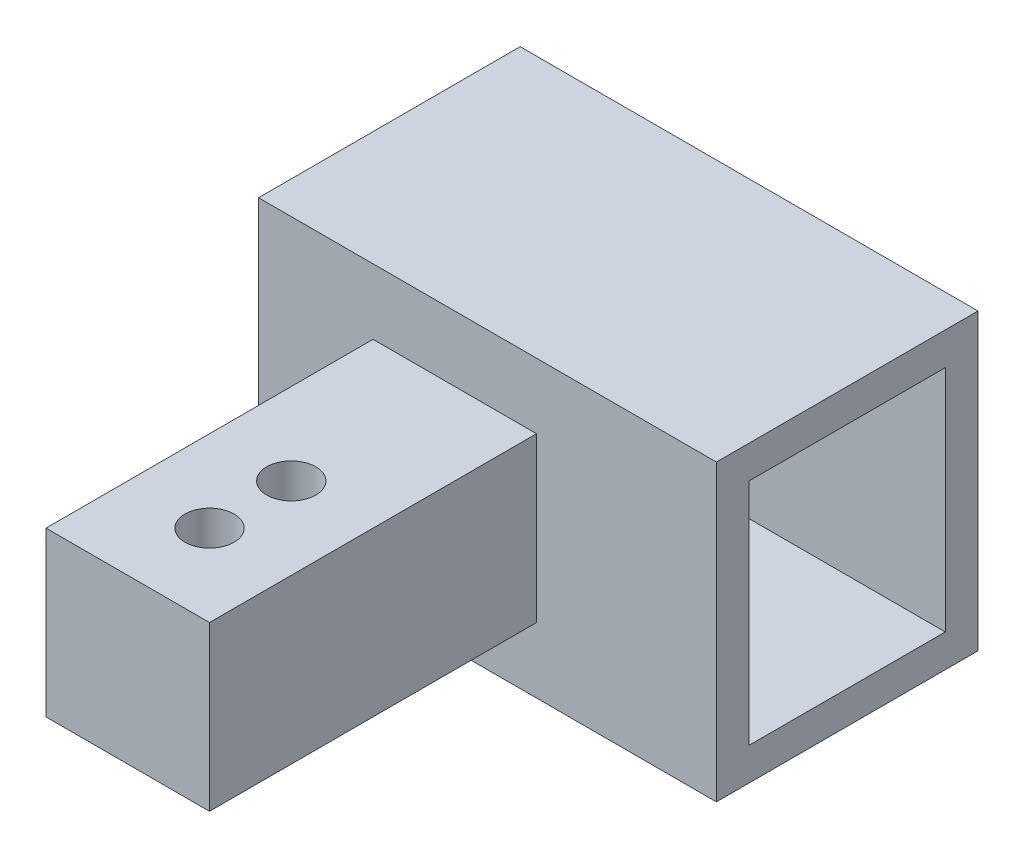
ISO-10303-21;
HEADER;
FILE_DESCRIPTION(('STEP AP214'),'2;1');
FILE_NAME('part.step','',(''),(''),'','','');
FILE_SCHEMA(('AUTOMOTIVE_DESIGN { 1 0 10303 214 1 1 1 1 }'));
ENDSEC;
DATA;
#1=APPLICATION_CONTEXT('core data for automotive mechanical design processes');
#2=APPLICATION_PROTOCOL_DEFINITION('international standard','automotive_design',2000,#1);
#3=PRODUCT_CONTEXT('',#1,'mechanical');
#4=PRODUCT('Part','Part','',(#3));
#5=PRODUCT_RELATED_PRODUCT_CATEGORY('part','',(#4));
#6=PRODUCT_DEFINITION_FORMATION('','',#4);
#7=PRODUCT_DEFINITION_CONTEXT('part definition',#1,'design');
#8=PRODUCT_DEFINITION('design','',#6,#7);
#9=PRODUCT_DEFINITION_SHAPE('','',#8);
#10=(LENGTH_UNIT() NAMED_UNIT(*) SI_UNIT(.MILLI.,.METRE.));
#11=(NAMED_UNIT(*) PLANE_ANGLE_UNIT() SI_UNIT($,.RADIAN.));
#12=(NAMED_UNIT(*) SI_UNIT($,.STERADIAN.) SOLID_ANGLE_UNIT());
#13=UNCERTAINTY_MEASURE_WITH_UNIT(LENGTH_MEASURE(1.E-05),#10,'distance_accuracy_value','');
#14=(GEOMETRIC_REPRESENTATION_CONTEXT(3) GLOBAL_UNCERTAINTY_ASSIGNED_CONTEXT((#13)) GLOBAL_UNIT_ASSIGNED_CONTEXT((#10,
#11,#12)) REPRESENTATION_CONTEXT('',''));
#15=CARTESIAN_POINT('',(0.,0.,0.));
#16=DIRECTION('',(0.,0.,1.));
#17=DIRECTION('',(1.,0.,0.));
#18=AXIS2_PLACEMENT_3D('',#15,#16,#17);
#19=CARTESIAN_POINT('',(-13.5384615384615,18.,10.6461538461538));
#20=DIRECTION('',(0.,0.,-1.));
#21=DIRECTION('',(-1.,0.,0.));
#22=AXIS2_PLACEMENT_3D('',#19,#20,#21);
#23=PLANE('',#22);
#24=DIRECTION('',(1.,0.,0.));
#25=VECTOR('',#24,1.);
#26=CARTESIAN_POINT('',(-13.5384615384615,0.,10.6461538461538));
#27=LINE('',#26,#25);
#28=CARTESIAN_POINT('',(-13.5384615384615,0.,10.6461538461538));
#29=VERTEX_POINT('',#28);
#30=CARTESIAN_POINT('',(14.4615384615385,0.,10.6461538461538));
#31=VERTEX_POINT('',#30);
#32=EDGE_CURVE('E216',#29,#31,#27,.T.);
#33=ORIENTED_EDGE('',*,*,#32,.T.);
#34=DIRECTION('',(0.,-1.,0.));
#35=VECTOR('',#34,1.);
#36=CARTESIAN_POINT('',(14.4615384615385,18.,10.6461538461538));
#37=LINE('',#36,#35);
#38=CARTESIAN_POINT('',(14.4615384615385,18.,10.6461538461538));
#39=VERTEX_POINT('',#38);
#40=EDGE_CURVE('E41',#39,#31,#37,.T.);
#41=ORIENTED_EDGE('',*,*,#40,.F.);
#42=DIRECTION('',(1.,0.,0.));
#43=VECTOR('',#42,1.);
#44=CARTESIAN_POINT('',(-13.5384615384615,18.,10.6461538461538));
#45=LINE('',#44,#43);
#46=CARTESIAN_POINT('',(-13.5384615384615,18.,10.6461538461538));
#47=VERTEX_POINT('',#46);
#48=EDGE_CURVE('E206',#47,#39,#45,.T.);
#49=ORIENTED_EDGE('',*,*,#48,.F.);
#50=DIRECTION('',(0.,-1.,0.));
#51=VECTOR('',#50,1.);
#52=CARTESIAN_POINT('',(-13.5384615384615,18.,10.6461538461538));
#53=LINE('',#52,#51);
#54=EDGE_CURVE('E11',#47,#29,#53,.T.);
#55=ORIENTED_EDGE('',*,*,#54,.T.);
#56=EDGE_LOOP('',(#33,#41,#49,#55));
#57=FACE_BOUND('',#56,.T.);
#58=DIRECTION('',(0.,-1.,0.));
#59=VECTOR('',#58,1.);
#60=CARTESIAN_POINT('',(-6.53846153846153,14.,10.6461538461538));
#61=LINE('',#60,#59);
#62=CARTESIAN_POINT('',(-6.53846153846153,14.,10.6461538461538));
#63=VERTEX_POINT('',#62);
#64=CARTESIAN_POINT('',(-6.53846153846153,4.,10.6461538461538));
#65=VERTEX_POINT('',#64);
#66=EDGE_CURVE('E169',#63,#65,#61,.T.);
#67=ORIENTED_EDGE('',*,*,#66,.F.);
#68=DIRECTION('',(-1.,0.,0.));
#69=VECTOR('',#68,1.);
#70=CARTESIAN_POINT('',(-6.53846153846153,14.,10.6461538461538));
#71=LINE('',#70,#69);
#72=CARTESIAN_POINT('',(3.46153846153847,14.,10.6461538461538));
#73=VERTEX_POINT('',#72);
#74=EDGE_CURVE('E177',#73,#63,#71,.T.);
#75=ORIENTED_EDGE('',*,*,#74,.F.);
#76=DIRECTION('',(0.,1.,0.));
#77=VECTOR('',#76,1.);
#78=CARTESIAN_POINT('',(3.46153846153847,14.,10.6461538461538));
#79=LINE('',#78,#77);
#80=CARTESIAN_POINT('',(3.46153846153847,4.,10.6461538461538));
#81=VERTEX_POINT('',#80);
#82=EDGE_CURVE('E187',#81,#73,#79,.T.);
#83=ORIENTED_EDGE('',*,*,#82,.F.);
#84=DIRECTION('',(1.,0.,0.));
#85=VECTOR('',#84,1.);
#86=CARTESIAN_POINT('',(-6.53846153846153,4.,10.6461538461538));
#87=LINE('',#86,#85);
#88=EDGE_CURVE('E56',#65,#81,#87,.T.);
#89=ORIENTED_EDGE('',*,*,#88,.F.);
#90=EDGE_LOOP('',(#67,#75,#83,#89));
#91=FACE_BOUND('',#90,.T.);
#92=ADVANCED_FACE('F33',(#57,#91),#23,.F.);
#93=CARTESIAN_POINT('',(-13.5384615384615,18.,-5.35384615384615));
#94=DIRECTION('',(1.,0.,0.));
#95=DIRECTION('',(0.,0.,-1.));
#96=AXIS2_PLACEMENT_3D('',#93,#94,#95);
#97=PLANE('',#96);
#98=DIRECTION('',(0.,0.,1.));
#99=VECTOR('',#98,1.);
#100=CARTESIAN_POINT('',(-13.5384615384615,0.,-5.35384615384615));
#101=LINE('',#100,#99);
#102=CARTESIAN_POINT('',(-13.5384615384615,0.,-5.35384615384615));
#103=VERTEX_POINT('',#102);
#104=EDGE_CURVE('E202',#103,#29,#101,.T.);
#105=ORIENTED_EDGE('',*,*,#104,.T.);
#106=ORIENTED_EDGE('',*,*,#54,.F.);
#107=DIRECTION('',(0.,0.,1.));
#108=VECTOR('',#107,1.);
#109=CARTESIAN_POINT('',(-13.5384615384615,18.,-5.35384615384615));
#110=LINE('',#109,#108);
#111=CARTESIAN_POINT('',(-13.5384615384615,18.,-5.35384615384615));
#112=VERTEX_POINT('',#111);
#113=EDGE_CURVE('E203',#112,#47,#110,.T.);
#114=ORIENTED_EDGE('',*,*,#113,.F.);
#115=DIRECTION('',(0.,-1.,0.));
#116=VECTOR('',#115,1.);
#117=CARTESIAN_POINT('',(-13.5384615384615,18.,-5.35384615384615));
#118=LINE('',#117,#116);
#119=EDGE_CURVE('E213',#112,#103,#118,.T.);
#120=ORIENTED_EDGE('',*,*,#119,.T.);
#121=EDGE_LOOP('',(#105,#106,#114,#120));
#122=FACE_BOUND('',#121,.T.);
#123=ADVANCED_FACE('F35',(#122),#97,.F.);
#124=CARTESIAN_POINT('',(14.4615384615385,18.,-5.35384615384615));
#125=DIRECTION('',(-1.,0.,0.));
#126=DIRECTION('',(0.,0.,1.));
#127=AXIS2_PLACEMENT_3D('',#124,#125,#126);
#128=PLANE('',#127);
#129=DIRECTION('',(0.,0.,-1.));
#130=VECTOR('',#129,1.);
#131=CARTESIAN_POINT('',(14.4615384615385,2.,8.64615384615385));
#132=LINE('',#131,#130);
#133=CARTESIAN_POINT('',(14.4615384615385,2.,8.64615384615385));
#134=VERTEX_POINT('',#133);
#135=CARTESIAN_POINT('',(14.4615384615385,2.,-3.35384615384615));
#136=VERTEX_POINT('',#135);
#137=EDGE_CURVE('E160',#134,#136,#132,.T.);
#138=ORIENTED_EDGE('',*,*,#137,.F.);
#139=DIRECTION('',(0.,-1.,0.));
#140=VECTOR('',#139,1.);
#141=CARTESIAN_POINT('',(14.4615384615385,16.,8.64615384615385));
#142=LINE('',#141,#140);
#143=CARTESIAN_POINT('',(14.4615384615385,16.,8.64615384615385));
#144=VERTEX_POINT('',#143);
#145=EDGE_CURVE('E48',#144,#134,#142,.T.);
#146=ORIENTED_EDGE('',*,*,#145,.F.);
#147=DIRECTION('',(0.,0.,1.));
#148=VECTOR('',#147,1.);
#149=CARTESIAN_POINT('',(14.4615384615385,16.,8.64615384615385));
#150=LINE('',#149,#148);
#151=CARTESIAN_POINT('',(14.4615384615385,16.,-3.35384615384615));
#152=VERTEX_POINT('',#151);
#153=EDGE_CURVE('E130',#152,#144,#150,.T.);
#154=ORIENTED_EDGE('',*,*,#153,.F.);
#155=DIRECTION('',(0.,1.,0.));
#156=VECTOR('',#155,1.);
#157=CARTESIAN_POINT('',(14.4615384615385,16.,-3.35384615384615));
#158=LINE('',#157,#156);
#159=EDGE_CURVE('E162',#136,#152,#158,.T.);
#160=ORIENTED_EDGE('',*,*,#159,.F.);
#161=EDGE_LOOP('',(#138,#146,#154,#160));
#162=FACE_BOUND('',#161,.T.);
#163=DIRECTION('',(0.,0.,-1.));
#164=VECTOR('',#163,1.);
#165=CARTESIAN_POINT('',(14.4615384615385,0.,-5.35384615384615));
#166=LINE('',#165,#164);
#167=CARTESIAN_POINT('',(14.4615384615385,0.,-5.35384615384615));
#168=VERTEX_POINT('',#167);
#169=EDGE_CURVE('E218',#31,#168,#166,.T.);
#170=ORIENTED_EDGE('',*,*,#169,.T.);
#171=DIRECTION('',(0.,-1.,0.));
#172=VECTOR('',#171,1.);
#173=CARTESIAN_POINT('',(14.4615384615385,18.,-5.35384615384615));
#174=LINE('',#173,#172);
#175=CARTESIAN_POINT('',(14.4615384615385,18.,-5.35384615384615));
#176=VERTEX_POINT('',#175);
#177=EDGE_CURVE('E223',#176,#168,#174,.T.);
#178=ORIENTED_EDGE('',*,*,#177,.F.);
#179=DIRECTION('',(0.,0.,-1.));
#180=VECTOR('',#179,1.);
#181=CARTESIAN_POINT('',(14.4615384615385,18.,-5.35384615384615));
#182=LINE('',#181,#180);
#183=EDGE_CURVE('E209',#39,#176,#182,.T.);
#184=ORIENTED_EDGE('',*,*,#183,.F.);
#185=ORIENTED_EDGE('',*,*,#40,.T.);
#186=EDGE_LOOP('',(#170,#178,#184,#185));
#187=FACE_BOUND('',#186,.T.);
#188=ADVANCED_FACE('F230',(#162,#187),#128,.F.);
#189=CARTESIAN_POINT('',(-13.5384615384615,18.,-5.35384615384615));
#190=DIRECTION('',(0.,0.,1.));
#191=DIRECTION('',(1.,0.,0.));
#192=AXIS2_PLACEMENT_3D('',#189,#190,#191);
#193=PLANE('',#192);
#194=DIRECTION('',(-1.,0.,0.));
#195=VECTOR('',#194,1.);
#196=CARTESIAN_POINT('',(-13.5384615384615,0.,-5.35384615384615));
#197=LINE('',#196,#195);
#198=EDGE_CURVE('E207',#168,#103,#197,.T.);
#199=ORIENTED_EDGE('',*,*,#198,.T.);
#200=ORIENTED_EDGE('',*,*,#119,.F.);
#201=DIRECTION('',(-1.,0.,0.));
#202=VECTOR('',#201,1.);
#203=CARTESIAN_POINT('',(-13.5384615384615,18.,-5.35384615384615));
#204=LINE('',#203,#202);
#205=EDGE_CURVE('E211',#176,#112,#204,.T.);
#206=ORIENTED_EDGE('',*,*,#205,.F.);
#207=ORIENTED_EDGE('',*,*,#177,.T.);
#208=EDGE_LOOP('',(#199,#200,#206,#207));
#209=FACE_BOUND('',#208,.T.);
#210=ADVANCED_FACE('F239',(#209),#193,.F.);
#211=CARTESIAN_POINT('',(0.,18.,0.));
#212=DIRECTION('',(0.,1.,0.));
#213=DIRECTION('',(0.,0.,1.));
#214=AXIS2_PLACEMENT_3D('',#211,#212,#213);
#215=PLANE('',#214);
#216=ORIENTED_EDGE('',*,*,#113,.T.);
#217=ORIENTED_EDGE('',*,*,#48,.T.);
#218=ORIENTED_EDGE('',*,*,#183,.T.);
#219=ORIENTED_EDGE('',*,*,#205,.T.);
#220=EDGE_LOOP('',(#216,#217,#218,#219));
#221=FACE_BOUND('',#220,.T.);
#222=ADVANCED_FACE('F245',(#221),#215,.T.);
#223=CARTESIAN_POINT('',(0.,0.,0.));
#224=DIRECTION('',(0.,1.,0.));
#225=DIRECTION('',(0.,0.,1.));
#226=AXIS2_PLACEMENT_3D('',#223,#224,#225);
#227=PLANE('',#226);
#228=ORIENTED_EDGE('',*,*,#104,.F.);
#229=ORIENTED_EDGE('',*,*,#198,.F.);
#230=ORIENTED_EDGE('',*,*,#169,.F.);
#231=ORIENTED_EDGE('',*,*,#32,.F.);
#232=EDGE_LOOP('',(#228,#229,#230,#231));
#233=FACE_BOUND('',#232,.T.);
#234=ADVANCED_FACE('F236',(#233),#227,.F.);
#235=CARTESIAN_POINT('',(-6.53846153846153,14.,30.6461538461539));
#236=DIRECTION('',(1.,0.,0.));
#237=DIRECTION('',(0.,0.,-1.));
#238=AXIS2_PLACEMENT_3D('',#235,#236,#237);
#239=PLANE('',#238);
#240=ORIENTED_EDGE('',*,*,#66,.T.);
#241=DIRECTION('',(0.,0.,-1.));
#242=VECTOR('',#241,1.);
#243=CARTESIAN_POINT('',(-6.53846153846153,4.,30.6461538461539));
#244=LINE('',#243,#242);
#245=CARTESIAN_POINT('',(-6.53846153846153,4.,30.6461538461539));
#246=VERTEX_POINT('',#245);
#247=EDGE_CURVE('E200',#246,#65,#244,.T.);
#248=ORIENTED_EDGE('',*,*,#247,.F.);
#249=DIRECTION('',(0.,-1.,0.));
#250=VECTOR('',#249,1.);
#251=CARTESIAN_POINT('',(-6.53846153846153,14.,30.6461538461539));
#252=LINE('',#251,#250);
#253=CARTESIAN_POINT('',(-6.53846153846153,14.,30.6461538461539));
#254=VERTEX_POINT('',#253);
#255=EDGE_CURVE('E173',#254,#246,#252,.T.);
#256=ORIENTED_EDGE('',*,*,#255,.F.);
#257=DIRECTION('',(0.,0.,-1.));
#258=VECTOR('',#257,1.);
#259=CARTESIAN_POINT('',(-6.53846153846153,14.,30.6461538461539));
#260=LINE('',#259,#258);
#261=EDGE_CURVE('E183',#254,#63,#260,.T.);
#262=ORIENTED_EDGE('',*,*,#261,.T.);
#263=EDGE_LOOP('',(#240,#248,#256,#262));
#264=FACE_BOUND('',#263,.T.);
#265=ADVANCED_FACE('F255',(#264),#239,.F.);
#266=CARTESIAN_POINT('',(-6.53846153846153,4.,30.6461538461539));
#267=DIRECTION('',(0.,1.,0.));
#268=DIRECTION('',(-1.,0.,0.));
#269=AXIS2_PLACEMENT_3D('',#266,#267,#268);
#270=PLANE('',#269);
#271=CARTESIAN_POINT('',(-1.53846153846153,4.,25.6461538461539));
#272=DIRECTION('',(0.,1.,0.));
#273=DIRECTION('',(-1.,0.,0.));
#274=AXIS2_PLACEMENT_3D('',#271,#272,#273);
#275=CIRCLE('',#274,1.5);
#276=CARTESIAN_POINT('',(-3.03846153846153,4.,25.6461538461539));
#277=VERTEX_POINT('',#276);
#278=EDGE_CURVE('E150',#277,#277,#275,.T.);
#279=ORIENTED_EDGE('',*,*,#278,.T.);
#280=EDGE_LOOP('',(#279));
#281=FACE_BOUND('',#280,.T.);
#282=CARTESIAN_POINT('',(-1.53846153846153,4.,20.6461538461538));
#283=DIRECTION('',(0.,1.,0.));
#284=DIRECTION('',(-1.,0.,0.));
#285=AXIS2_PLACEMENT_3D('',#282,#283,#284);
#286=CIRCLE('',#285,1.5);
#287=CARTESIAN_POINT('',(-3.03846153846153,4.,20.6461538461538));
#288=VERTEX_POINT('',#287);
#289=EDGE_CURVE('E156',#288,#288,#286,.T.);
#290=ORIENTED_EDGE('',*,*,#289,.T.);
#291=EDGE_LOOP('',(#290));
#292=FACE_BOUND('',#291,.T.);
#293=ORIENTED_EDGE('',*,*,#88,.T.);
#294=DIRECTION('',(0.,0.,-1.));
#295=VECTOR('',#294,1.);
#296=CARTESIAN_POINT('',(3.46153846153847,4.,30.6461538461539));
#297=LINE('',#296,#295);
#298=CARTESIAN_POINT('',(3.46153846153847,4.,30.6461538461539));
#299=VERTEX_POINT('',#298);
#300=EDGE_CURVE('E197',#299,#81,#297,.T.);
#301=ORIENTED_EDGE('',*,*,#300,.F.);
#302=DIRECTION('',(1.,0.,0.));
#303=VECTOR('',#302,1.);
#304=CARTESIAN_POINT('',(-6.53846153846153,4.,30.6461538461539));
#305=LINE('',#304,#303);
#306=EDGE_CURVE('E176',#246,#299,#305,.T.);
#307=ORIENTED_EDGE('',*,*,#306,.F.);
#308=ORIENTED_EDGE('',*,*,#247,.T.);
#309=EDGE_LOOP('',(#293,#301,#307,#308));
#310=FACE_BOUND('',#309,.T.);
#311=ADVANCED_FACE('F263',(#281,#292,#310),#270,.F.);
#312=CARTESIAN_POINT('',(3.46153846153847,14.,30.6461538461539));
#313=DIRECTION('',(-1.,0.,0.));
#314=DIRECTION('',(0.,-1.,0.));
#315=AXIS2_PLACEMENT_3D('',#312,#313,#314);
#316=PLANE('',#315);
#317=ORIENTED_EDGE('',*,*,#82,.T.);
#318=DIRECTION('',(0.,0.,-1.));
#319=VECTOR('',#318,1.);
#320=CARTESIAN_POINT('',(3.46153846153847,14.,30.6461538461539));
#321=LINE('',#320,#319);
#322=CARTESIAN_POINT('',(3.46153846153847,14.,30.6461538461539));
#323=VERTEX_POINT('',#322);
#324=EDGE_CURVE('E194',#323,#73,#321,.T.);
#325=ORIENTED_EDGE('',*,*,#324,.F.);
#326=DIRECTION('',(0.,1.,0.));
#327=VECTOR('',#326,1.);
#328=CARTESIAN_POINT('',(3.46153846153847,14.,30.6461538461539));
#329=LINE('',#328,#327);
#330=EDGE_CURVE('E179',#299,#323,#329,.T.);
#331=ORIENTED_EDGE('',*,*,#330,.F.);
#332=ORIENTED_EDGE('',*,*,#300,.T.);
#333=EDGE_LOOP('',(#317,#325,#331,#332));
#334=FACE_BOUND('',#333,.T.);
#335=ADVANCED_FACE('F261',(#334),#316,.F.);
#336=CARTESIAN_POINT('',(-6.53846153846153,14.,30.6461538461539));
#337=DIRECTION('',(0.,-1.,0.));
#338=DIRECTION('',(1.,0.,0.));
#339=AXIS2_PLACEMENT_3D('',#336,#337,#338);
#340=PLANE('',#339);
#341=CARTESIAN_POINT('',(-1.53846153846153,14.,25.6461538461539));
#342=DIRECTION('',(0.,1.,0.));
#343=DIRECTION('',(-1.,0.,0.));
#344=AXIS2_PLACEMENT_3D('',#341,#342,#343);
#345=CIRCLE('',#344,1.5);
#346=CARTESIAN_POINT('',(-3.03846153846153,14.,25.6461538461539));
#347=VERTEX_POINT('',#346);
#348=EDGE_CURVE('E147',#347,#347,#345,.T.);
#349=ORIENTED_EDGE('',*,*,#348,.F.);
#350=EDGE_LOOP('',(#349));
#351=FACE_BOUND('',#350,.T.);
#352=CARTESIAN_POINT('',(-1.53846153846153,14.,20.6461538461538));
#353=DIRECTION('',(0.,1.,0.));
#354=DIRECTION('',(-1.,0.,0.));
#355=AXIS2_PLACEMENT_3D('',#352,#353,#354);
#356=CIRCLE('',#355,1.5);
#357=CARTESIAN_POINT('',(-3.03846153846153,14.,20.6461538461538));
#358=VERTEX_POINT('',#357);
#359=EDGE_CURVE('E153',#358,#358,#356,.T.);
#360=ORIENTED_EDGE('',*,*,#359,.F.);
#361=EDGE_LOOP('',(#360));
#362=FACE_BOUND('',#361,.T.);
#363=ORIENTED_EDGE('',*,*,#74,.T.);
#364=ORIENTED_EDGE('',*,*,#261,.F.);
#365=DIRECTION('',(-1.,0.,0.));
#366=VECTOR('',#365,1.);
#367=CARTESIAN_POINT('',(-6.53846153846153,14.,30.6461538461539));
#368=LINE('',#367,#366);
#369=EDGE_CURVE('E181',#323,#254,#368,.T.);
#370=ORIENTED_EDGE('',*,*,#369,.F.);
#371=ORIENTED_EDGE('',*,*,#324,.T.);
#372=EDGE_LOOP('',(#363,#364,#370,#371));
#373=FACE_BOUND('',#372,.T.);
#374=ADVANCED_FACE('F251',(#351,#362,#373),#340,.F.);
#375=CARTESIAN_POINT('',(0.,0.,30.6461538461539));
#376=DIRECTION('',(0.,0.,1.));
#377=DIRECTION('',(1.,0.,0.));
#378=AXIS2_PLACEMENT_3D('',#375,#376,#377);
#379=PLANE('',#378);
#380=ORIENTED_EDGE('',*,*,#255,.T.);
#381=ORIENTED_EDGE('',*,*,#306,.T.);
#382=ORIENTED_EDGE('',*,*,#330,.T.);
#383=ORIENTED_EDGE('',*,*,#369,.T.);
#384=EDGE_LOOP('',(#380,#381,#382,#383));
#385=FACE_BOUND('',#384,.T.);
#386=ADVANCED_FACE('F257',(#385),#379,.T.);
#387=CARTESIAN_POINT('',(-10.5384615384615,16.,8.64615384615385));
#388=DIRECTION('',(0.,0.,1.));
#389=DIRECTION('',(1.,0.,0.));
#390=AXIS2_PLACEMENT_3D('',#387,#388,#389);
#391=PLANE('',#390);
#392=ORIENTED_EDGE('',*,*,#145,.T.);
#393=DIRECTION('',(1.,0.,0.));
#394=VECTOR('',#393,1.);
#395=CARTESIAN_POINT('',(-10.5384615384615,2.,8.64615384615385));
#396=LINE('',#395,#394);
#397=CARTESIAN_POINT('',(-11.5384615384615,2.,8.64615384615385));
#398=VERTEX_POINT('',#397);
#399=EDGE_CURVE('E120',#398,#134,#396,.T.);
#400=ORIENTED_EDGE('',*,*,#399,.F.);
#401=DIRECTION('',(0.,-1.,0.));
#402=VECTOR('',#401,1.);
#403=CARTESIAN_POINT('',(-11.5384615384615,16.,8.64615384615385));
#404=LINE('',#403,#402);
#405=CARTESIAN_POINT('',(-11.5384615384615,16.,8.64615384615385));
#406=VERTEX_POINT('',#405);
#407=EDGE_CURVE('E124',#406,#398,#404,.T.);
#408=ORIENTED_EDGE('',*,*,#407,.F.);
#409=DIRECTION('',(1.,0.,0.));
#410=VECTOR('',#409,1.);
#411=CARTESIAN_POINT('',(-10.5384615384615,16.,8.64615384615385));
#412=LINE('',#411,#410);
#413=EDGE_CURVE('E167',#406,#144,#412,.T.);
#414=ORIENTED_EDGE('',*,*,#413,.T.);
#415=EDGE_LOOP('',(#392,#400,#408,#414));
#416=FACE_BOUND('',#415,.T.);
#417=ADVANCED_FACE('F122',(#416),#391,.F.);
#418=CARTESIAN_POINT('',(-10.5384615384615,16.,8.64615384615385));
#419=DIRECTION('',(0.,1.,0.));
#420=DIRECTION('',(0.,0.,1.));
#421=AXIS2_PLACEMENT_3D('',#418,#419,#420);
#422=PLANE('',#421);
#423=ORIENTED_EDGE('',*,*,#153,.T.);
#424=ORIENTED_EDGE('',*,*,#413,.F.);
#425=DIRECTION('',(0.,0.,1.));
#426=VECTOR('',#425,1.);
#427=CARTESIAN_POINT('',(-11.5384615384615,16.,8.64615384615385));
#428=LINE('',#427,#426);
#429=CARTESIAN_POINT('',(-11.5384615384615,16.,-3.35384615384615));
#430=VERTEX_POINT('',#429);
#431=EDGE_CURVE('E142',#430,#406,#428,.T.);
#432=ORIENTED_EDGE('',*,*,#431,.F.);
#433=DIRECTION('',(1.,0.,0.));
#434=VECTOR('',#433,1.);
#435=CARTESIAN_POINT('',(-10.5384615384615,16.,-3.35384615384615));
#436=LINE('',#435,#434);
#437=EDGE_CURVE('E170',#430,#152,#436,.T.);
#438=ORIENTED_EDGE('',*,*,#437,.T.);
#439=EDGE_LOOP('',(#423,#424,#432,#438));
#440=FACE_BOUND('',#439,.T.);
#441=ADVANCED_FACE('F292',(#440),#422,.F.);
#442=CARTESIAN_POINT('',(-10.5384615384615,16.,-3.35384615384615));
#443=DIRECTION('',(0.,0.,-1.));
#444=DIRECTION('',(-1.,0.,0.));
#445=AXIS2_PLACEMENT_3D('',#442,#443,#444);
#446=PLANE('',#445);
#447=ORIENTED_EDGE('',*,*,#159,.T.);
#448=ORIENTED_EDGE('',*,*,#437,.F.);
#449=DIRECTION('',(0.,1.,0.));
#450=VECTOR('',#449,1.);
#451=CARTESIAN_POINT('',(-11.5384615384615,16.,-3.35384615384615));
#452=LINE('',#451,#450);
#453=CARTESIAN_POINT('',(-11.5384615384615,2.,-3.35384615384615));
#454=VERTEX_POINT('',#453);
#455=EDGE_CURVE('E138',#454,#430,#452,.T.);
#456=ORIENTED_EDGE('',*,*,#455,.F.);
#457=DIRECTION('',(1.,0.,0.));
#458=VECTOR('',#457,1.);
#459=CARTESIAN_POINT('',(-10.5384615384615,2.,-3.35384615384615));
#460=LINE('',#459,#458);
#461=EDGE_CURVE('E129',#454,#136,#460,.T.);
#462=ORIENTED_EDGE('',*,*,#461,.T.);
#463=EDGE_LOOP('',(#447,#448,#456,#462));
#464=FACE_BOUND('',#463,.T.);
#465=ADVANCED_FACE('F290',(#464),#446,.F.);
#466=CARTESIAN_POINT('',(-10.5384615384615,2.,8.64615384615385));
#467=DIRECTION('',(0.,-1.,0.));
#468=DIRECTION('',(0.,0.,-1.));
#469=AXIS2_PLACEMENT_3D('',#466,#467,#468);
#470=PLANE('',#469);
#471=ORIENTED_EDGE('',*,*,#137,.T.);
#472=ORIENTED_EDGE('',*,*,#461,.F.);
#473=DIRECTION('',(0.,0.,-1.));
#474=VECTOR('',#473,1.);
#475=CARTESIAN_POINT('',(-11.5384615384615,2.,8.64615384615385));
#476=LINE('',#475,#474);
#477=EDGE_CURVE('E133',#398,#454,#476,.T.);
#478=ORIENTED_EDGE('',*,*,#477,.F.);
#479=ORIENTED_EDGE('',*,*,#399,.T.);
#480=EDGE_LOOP('',(#471,#472,#478,#479));
#481=FACE_BOUND('',#480,.T.);
#482=ADVANCED_FACE('F134',(#481),#470,.F.);
#483=CARTESIAN_POINT('',(-1.53846153846154,-11.,20.6461538461538));
#484=DIRECTION('',(0.,1.,0.));
#485=DIRECTION('',(-1.,0.,0.));
#486=AXIS2_PLACEMENT_3D('',#483,#484,#485);
#487=CYLINDRICAL_SURFACE('',#486,1.5);
#488=ORIENTED_EDGE('',*,*,#359,.T.);
#489=EDGE_LOOP('',(#488));
#490=FACE_BOUND('',#489,.T.);
#491=ORIENTED_EDGE('',*,*,#289,.F.);
#492=EDGE_LOOP('',(#491));
#493=FACE_BOUND('',#492,.T.);
#494=ADVANCED_FACE('F302',(#490,#493),#487,.F.);
#495=CARTESIAN_POINT('',(-1.53846153846154,-11.,25.6461538461539));
#496=DIRECTION('',(0.,1.,0.));
#497=DIRECTION('',(-1.,0.,0.));
#498=AXIS2_PLACEMENT_3D('',#495,#496,#497);
#499=CYLINDRICAL_SURFACE('',#498,1.5);
#500=ORIENTED_EDGE('',*,*,#348,.T.);
#501=EDGE_LOOP('',(#500));
#502=FACE_BOUND('',#501,.T.);
#503=ORIENTED_EDGE('',*,*,#278,.F.);
#504=EDGE_LOOP('',(#503));
#505=FACE_BOUND('',#504,.T.);
#506=ADVANCED_FACE('F318',(#502,#505),#499,.F.);
#507=CARTESIAN_POINT('',(-11.5384615384615,0.,0.));
#508=DIRECTION('',(1.,0.,0.));
#509=DIRECTION('',(0.,0.,-1.));
#510=AXIS2_PLACEMENT_3D('',#507,#508,#509);
#511=PLANE('',#510);
#512=ORIENTED_EDGE('',*,*,#407,.T.);
#513=ORIENTED_EDGE('',*,*,#477,.T.);
#514=ORIENTED_EDGE('',*,*,#455,.T.);
#515=ORIENTED_EDGE('',*,*,#431,.T.);
#516=EDGE_LOOP('',(#512,#513,#514,#515));
#517=FACE_BOUND('',#516,.T.);
#518=ADVANCED_FACE('F140',(#517),#511,.T.);
#519=CLOSED_SHELL('',(#92,#123,#188,#210,#222,#234,#265,#311,#335,#374,#386,#417,#441,#465,#482,
#494,#506,#518));
#520=MANIFOLD_SOLID_BREP('B2',#519);
#521=ADVANCED_BREP_SHAPE_REPRESENTATION('',(#18,#520),#14);
#522=SHAPE_DEFINITION_REPRESENTATION(#9,#521);
ENDSEC;
END-ISO-10303-21;
